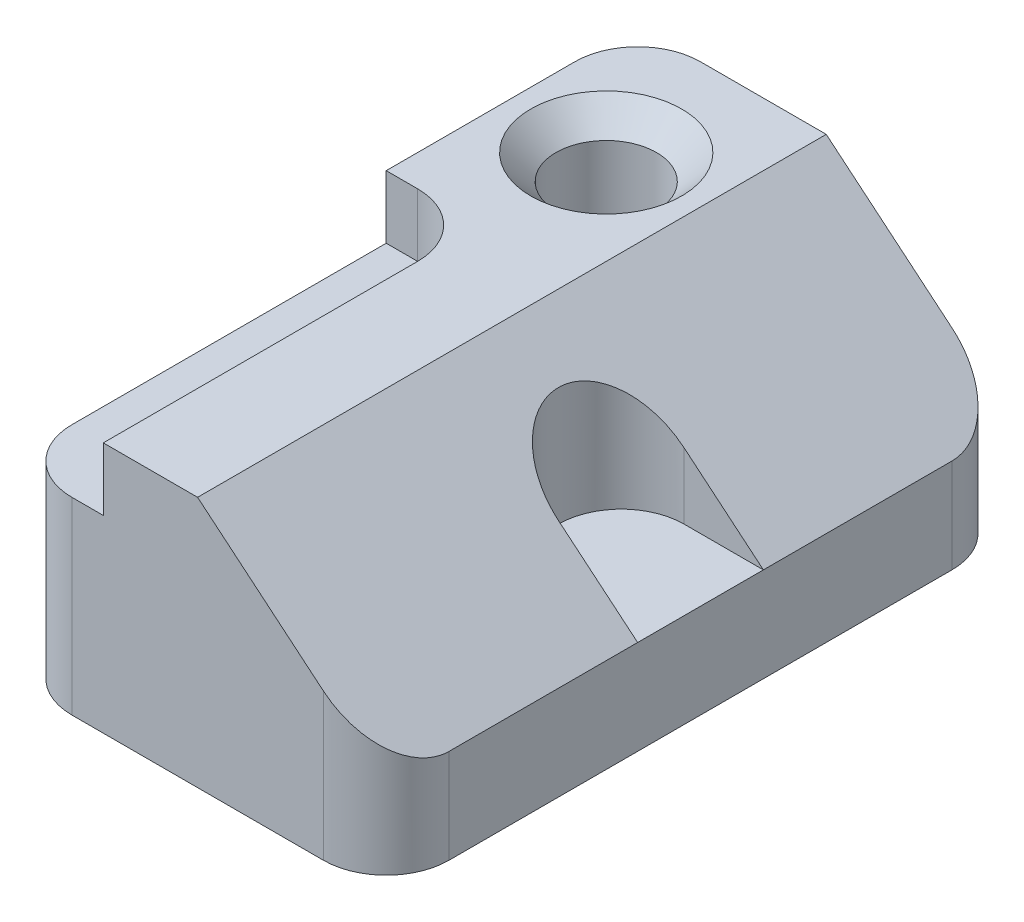
ISO-10303-21;
HEADER;
FILE_DESCRIPTION(('STEP AP214'),'2;1');
FILE_NAME('part.step','',(''),(''),'','','');
FILE_SCHEMA(('AUTOMOTIVE_DESIGN { 1 0 10303 214 1 1 1 1 }'));
ENDSEC;
DATA;
#1=APPLICATION_CONTEXT('core data for automotive mechanical design processes');
#2=APPLICATION_PROTOCOL_DEFINITION('international standard','automotive_design',2000,#1);
#3=PRODUCT_CONTEXT('',#1,'mechanical');
#4=PRODUCT('Part','Part','',(#3));
#5=PRODUCT_RELATED_PRODUCT_CATEGORY('part','',(#4));
#6=PRODUCT_DEFINITION_FORMATION('','',#4);
#7=PRODUCT_DEFINITION_CONTEXT('part definition',#1,'design');
#8=PRODUCT_DEFINITION('design','',#6,#7);
#9=PRODUCT_DEFINITION_SHAPE('','',#8);
#10=(LENGTH_UNIT() NAMED_UNIT(*) SI_UNIT(.MILLI.,.METRE.));
#11=(NAMED_UNIT(*) PLANE_ANGLE_UNIT() SI_UNIT($,.RADIAN.));
#12=(NAMED_UNIT(*) SI_UNIT($,.STERADIAN.) SOLID_ANGLE_UNIT());
#13=UNCERTAINTY_MEASURE_WITH_UNIT(LENGTH_MEASURE(1.E-05),#10,'distance_accuracy_value','');
#14=(GEOMETRIC_REPRESENTATION_CONTEXT(3) GLOBAL_UNCERTAINTY_ASSIGNED_CONTEXT((#13)) GLOBAL_UNIT_ASSIGNED_CONTEXT((#10,
#11,#12)) REPRESENTATION_CONTEXT('',''));
#15=CARTESIAN_POINT('',(0.,0.,0.));
#16=DIRECTION('',(0.,0.,1.));
#17=DIRECTION('',(1.,0.,0.));
#18=AXIS2_PLACEMENT_3D('',#15,#16,#17);
#19=CARTESIAN_POINT('',(0.,50.8,127.));
#20=DIRECTION('',(0.,1.,0.));
#21=DIRECTION('',(0.,0.,1.));
#22=AXIS2_PLACEMENT_3D('',#19,#20,#21);
#23=PLANE('',#22);
#24=CARTESIAN_POINT('',(19.05,50.8,25.4));
#25=DIRECTION('',(0.,1.,0.));
#26=DIRECTION('',(0.,0.,1.));
#27=AXIS2_PLACEMENT_3D('',#24,#25,#26);
#28=CIRCLE('',#27,15.24);
#29=CARTESIAN_POINT('',(19.05,50.8,40.64));
#30=VERTEX_POINT('',#29);
#31=EDGE_CURVE('E226',#30,#30,#28,.F.);
#32=ORIENTED_EDGE('',*,*,#31,.T.);
#33=EDGE_LOOP('',(#32));
#34=FACE_BOUND('',#33,.T.);
#35=DIRECTION('',(1.,0.,0.));
#36=VECTOR('',#35,1.);
#37=CARTESIAN_POINT('',(0.,50.8,0.));
#38=LINE('',#37,#36);
#39=CARTESIAN_POINT('',(12.7,50.8,0.));
#40=VERTEX_POINT('',#39);
#41=CARTESIAN_POINT('',(38.1,50.8,0.));
#42=VERTEX_POINT('',#41);
#43=EDGE_CURVE('E301',#40,#42,#38,.T.);
#44=ORIENTED_EDGE('',*,*,#43,.F.);
#45=CARTESIAN_POINT('',(12.7,50.8,12.7));
#46=DIRECTION('',(0.,1.,0.));
#47=DIRECTION('',(0.,0.,1.));
#48=AXIS2_PLACEMENT_3D('',#45,#46,#47);
#49=CIRCLE('',#48,12.7);
#50=CARTESIAN_POINT('',(0.,50.8,12.7));
#51=VERTEX_POINT('',#50);
#52=EDGE_CURVE('E64',#40,#51,#49,.T.);
#53=ORIENTED_EDGE('',*,*,#52,.T.);
#54=DIRECTION('',(0.,0.,-1.));
#55=VECTOR('',#54,1.);
#56=CARTESIAN_POINT('',(0.,50.8,127.));
#57=LINE('',#56,#55);
#58=CARTESIAN_POINT('',(0.,50.8,50.8));
#59=VERTEX_POINT('',#58);
#60=EDGE_CURVE('E202',#59,#51,#57,.T.);
#61=ORIENTED_EDGE('',*,*,#60,.F.);
#62=DIRECTION('',(1.,0.,0.));
#63=VECTOR('',#62,1.);
#64=CARTESIAN_POINT('',(0.,50.8,50.8));
#65=LINE('',#64,#63);
#66=CARTESIAN_POINT('',(6.35,50.8,50.8));
#67=VERTEX_POINT('',#66);
#68=EDGE_CURVE('E222',#59,#67,#65,.T.);
#69=ORIENTED_EDGE('',*,*,#68,.T.);
#70=CARTESIAN_POINT('',(6.35,50.8,63.5));
#71=DIRECTION('',(0.,1.,0.));
#72=DIRECTION('',(0.,0.,1.));
#73=AXIS2_PLACEMENT_3D('',#70,#71,#72);
#74=CIRCLE('',#73,12.7);
#75=CARTESIAN_POINT('',(19.05,50.8,63.5));
#76=VERTEX_POINT('',#75);
#77=EDGE_CURVE('E188',#67,#76,#74,.F.);
#78=ORIENTED_EDGE('',*,*,#77,.T.);
#79=DIRECTION('',(0.,0.,1.));
#80=VECTOR('',#79,1.);
#81=CARTESIAN_POINT('',(19.05,50.8,127.));
#82=LINE('',#81,#80);
#83=CARTESIAN_POINT('',(19.05,50.8,127.));
#84=VERTEX_POINT('',#83);
#85=EDGE_CURVE('E324',#76,#84,#82,.T.);
#86=ORIENTED_EDGE('',*,*,#85,.T.);
#87=DIRECTION('',(1.,0.,0.));
#88=VECTOR('',#87,1.);
#89=CARTESIAN_POINT('',(0.,50.8,127.));
#90=LINE('',#89,#88);
#91=CARTESIAN_POINT('',(38.1,50.8,127.));
#92=VERTEX_POINT('',#91);
#93=EDGE_CURVE('E316',#84,#92,#90,.T.);
#94=ORIENTED_EDGE('',*,*,#93,.T.);
#95=DIRECTION('',(0.,0.,-1.));
#96=VECTOR('',#95,1.);
#97=CARTESIAN_POINT('',(38.1,50.8,127.));
#98=LINE('',#97,#96);
#99=EDGE_CURVE('E196',#92,#42,#98,.T.);
#100=ORIENTED_EDGE('',*,*,#99,.T.);
#101=EDGE_LOOP('',(#44,#53,#61,#69,#78,#86,#94,#100));
#102=FACE_BOUND('',#101,.T.);
#103=ADVANCED_FACE('F41',(#34,#102),#23,.T.);
#104=CARTESIAN_POINT('',(0.,0.,127.));
#105=DIRECTION('',(-1.,0.,0.));
#106=DIRECTION('',(0.,0.,1.));
#107=AXIS2_PLACEMENT_3D('',#104,#105,#106);
#108=PLANE('',#107);
#109=ORIENTED_EDGE('',*,*,#60,.T.);
#110=DIRECTION('',(0.,1.,0.));
#111=VECTOR('',#110,1.);
#112=CARTESIAN_POINT('',(0.,0.,12.7));
#113=LINE('',#112,#111);
#114=CARTESIAN_POINT('',(0.,0.,12.7));
#115=VERTEX_POINT('',#114);
#116=EDGE_CURVE('E50',#51,#115,#113,.F.);
#117=ORIENTED_EDGE('',*,*,#116,.T.);
#118=DIRECTION('',(0.,0.,-1.));
#119=VECTOR('',#118,1.);
#120=CARTESIAN_POINT('',(0.,0.,127.));
#121=LINE('',#120,#119);
#122=CARTESIAN_POINT('',(0.,0.,114.3));
#123=VERTEX_POINT('',#122);
#124=EDGE_CURVE('E210',#123,#115,#121,.T.);
#125=ORIENTED_EDGE('',*,*,#124,.F.);
#126=DIRECTION('',(0.,1.,0.));
#127=VECTOR('',#126,1.);
#128=CARTESIAN_POINT('',(0.,38.1,114.3));
#129=LINE('',#128,#127);
#130=CARTESIAN_POINT('',(0.,38.1,114.3));
#131=VERTEX_POINT('',#130);
#132=EDGE_CURVE('E251',#123,#131,#129,.T.);
#133=ORIENTED_EDGE('',*,*,#132,.T.);
#134=DIRECTION('',(0.,0.,1.));
#135=VECTOR('',#134,1.);
#136=CARTESIAN_POINT('',(0.,38.1,127.));
#137=LINE('',#136,#135);
#138=CARTESIAN_POINT('',(0.,38.1,50.8));
#139=VERTEX_POINT('',#138);
#140=EDGE_CURVE('E341',#139,#131,#137,.T.);
#141=ORIENTED_EDGE('',*,*,#140,.F.);
#142=DIRECTION('',(0.,-1.,0.));
#143=VECTOR('',#142,1.);
#144=CARTESIAN_POINT('',(0.,50.800012,50.8));
#145=LINE('',#144,#143);
#146=EDGE_CURVE('E327',#59,#139,#145,.T.);
#147=ORIENTED_EDGE('',*,*,#146,.F.);
#148=EDGE_LOOP('',(#109,#117,#125,#133,#141,#147));
#149=FACE_BOUND('',#148,.T.);
#150=ADVANCED_FACE('F376',(#149),#108,.T.);
#151=CARTESIAN_POINT('',(0.,0.,127.));
#152=DIRECTION('',(0.,0.,-1.));
#153=DIRECTION('',(-1.,0.,0.));
#154=AXIS2_PLACEMENT_3D('',#151,#152,#153);
#155=PLANE('',#154);
#156=DIRECTION('',(-1.,0.,0.));
#157=VECTOR('',#156,1.);
#158=CARTESIAN_POINT('',(76.2,0.,127.));
#159=LINE('',#158,#157);
#160=CARTESIAN_POINT('',(63.5,0.,127.));
#161=VERTEX_POINT('',#160);
#162=CARTESIAN_POINT('',(12.7,0.,127.));
#163=VERTEX_POINT('',#162);
#164=EDGE_CURVE('E310',#161,#163,#159,.T.);
#165=ORIENTED_EDGE('',*,*,#164,.F.);
#166=DIRECTION('',(0.,-1.,0.));
#167=VECTOR('',#166,1.);
#168=CARTESIAN_POINT('',(63.5,19.05,127.));
#169=LINE('',#168,#167);
#170=CARTESIAN_POINT('',(63.5,29.6333333333333,127.));
#171=VERTEX_POINT('',#170);
#172=EDGE_CURVE('E272',#161,#171,#169,.F.);
#173=ORIENTED_EDGE('',*,*,#172,.T.);
#174=DIRECTION('',(0.768221279597376,-0.64018439966448,0.));
#175=VECTOR('',#174,1.);
#176=CARTESIAN_POINT('',(38.1,50.8,127.));
#177=LINE('',#176,#175);
#178=EDGE_CURVE('E216',#92,#171,#177,.T.);
#179=ORIENTED_EDGE('',*,*,#178,.F.);
#180=ORIENTED_EDGE('',*,*,#93,.F.);
#181=DIRECTION('',(0.,1.,0.));
#182=VECTOR('',#181,1.);
#183=CARTESIAN_POINT('',(19.05,0.,127.));
#184=LINE('',#183,#182);
#185=CARTESIAN_POINT('',(19.05,38.1,127.));
#186=VERTEX_POINT('',#185);
#187=EDGE_CURVE('E230',#186,#84,#184,.T.);
#188=ORIENTED_EDGE('',*,*,#187,.F.);
#189=DIRECTION('',(1.,0.,0.));
#190=VECTOR('',#189,1.);
#191=CARTESIAN_POINT('',(0.,38.1,127.));
#192=LINE('',#191,#190);
#193=CARTESIAN_POINT('',(12.7,38.1,127.));
#194=VERTEX_POINT('',#193);
#195=EDGE_CURVE('E338',#194,#186,#192,.T.);
#196=ORIENTED_EDGE('',*,*,#195,.F.);
#197=DIRECTION('',(0.,1.,0.));
#198=VECTOR('',#197,1.);
#199=CARTESIAN_POINT('',(12.7,0.,127.));
#200=LINE('',#199,#198);
#201=EDGE_CURVE('E258',#194,#163,#200,.F.);
#202=ORIENTED_EDGE('',*,*,#201,.T.);
#203=EDGE_LOOP('',(#165,#173,#179,#180,#188,#196,#202));
#204=FACE_BOUND('',#203,.T.);
#205=ADVANCED_FACE('F367',(#204),#155,.F.);
#206=CARTESIAN_POINT('',(76.2,19.05,127.));
#207=DIRECTION('',(1.,0.,0.));
#208=DIRECTION('',(0.,0.,-1.));
#209=AXIS2_PLACEMENT_3D('',#206,#207,#208);
#210=PLANE('',#209);
#211=DIRECTION('',(0.,0.,-1.));
#212=VECTOR('',#211,1.);
#213=CARTESIAN_POINT('',(76.2,0.,127.));
#214=LINE('',#213,#212);
#215=CARTESIAN_POINT('',(76.2,0.,114.3));
#216=VERTEX_POINT('',#215);
#217=CARTESIAN_POINT('',(76.2,0.,12.7));
#218=VERTEX_POINT('',#217);
#219=EDGE_CURVE('E213',#216,#218,#214,.T.);
#220=ORIENTED_EDGE('',*,*,#219,.T.);
#221=DIRECTION('',(0.,-1.,0.));
#222=VECTOR('',#221,1.);
#223=CARTESIAN_POINT('',(76.2,19.05,12.7));
#224=LINE('',#223,#222);
#225=CARTESIAN_POINT('',(76.2,19.05,12.7));
#226=VERTEX_POINT('',#225);
#227=EDGE_CURVE('E193',#218,#226,#224,.F.);
#228=ORIENTED_EDGE('',*,*,#227,.T.);
#229=DIRECTION('',(0.,0.,-1.));
#230=VECTOR('',#229,1.);
#231=CARTESIAN_POINT('',(76.2,19.05,127.));
#232=LINE('',#231,#230);
#233=CARTESIAN_POINT('',(76.2,19.05,50.8));
#234=VERTEX_POINT('',#233);
#235=EDGE_CURVE('E183',#234,#226,#232,.T.);
#236=ORIENTED_EDGE('',*,*,#235,.F.);
#237=DIRECTION('',(0.,0.,-1.));
#238=VECTOR('',#237,1.);
#239=CARTESIAN_POINT('',(76.2,19.05,50.8));
#240=LINE('',#239,#238);
#241=CARTESIAN_POINT('',(76.2,19.05,76.2));
#242=VERTEX_POINT('',#241);
#243=EDGE_CURVE('E166',#242,#234,#240,.T.);
#244=ORIENTED_EDGE('',*,*,#243,.F.);
#245=CARTESIAN_POINT('',(76.2,19.05,114.3));
#246=VERTEX_POINT('',#245);
#247=EDGE_CURVE('E195',#246,#242,#232,.T.);
#248=ORIENTED_EDGE('',*,*,#247,.F.);
#249=DIRECTION('',(0.,-1.,0.));
#250=VECTOR('',#249,1.);
#251=CARTESIAN_POINT('',(76.2,0.,114.3));
#252=LINE('',#251,#250);
#253=EDGE_CURVE('E265',#246,#216,#252,.T.);
#254=ORIENTED_EDGE('',*,*,#253,.T.);
#255=EDGE_LOOP('',(#220,#228,#236,#244,#248,#254));
#256=FACE_BOUND('',#255,.T.);
#257=ADVANCED_FACE('F191',(#256),#210,.T.);
#258=CARTESIAN_POINT('',(38.1,50.8,127.));
#259=DIRECTION('',(0.64018439966448,0.768221279597376,0.));
#260=DIRECTION('',(-0.768221279597376,0.64018439966448,0.));
#261=AXIS2_PLACEMENT_3D('',#258,#259,#260);
#262=PLANE('',#261);
#263=ORIENTED_EDGE('',*,*,#235,.T.);
#264=CARTESIAN_POINT('',(63.5,29.6333333333333,12.7));
#265=DIRECTION('',(0.64018439966448,0.768221279597376,0.));
#266=DIRECTION('',(0.768221279597376,-0.64018439966448,0.));
#267=AXIS2_PLACEMENT_3D('',#264,#265,#266);
#268=ELLIPSE('',#267,16.5316951473357,12.7);
#269=CARTESIAN_POINT('',(63.5,29.6333333333333,0.));
#270=VERTEX_POINT('',#269);
#271=EDGE_CURVE('E287',#226,#270,#268,.T.);
#272=ORIENTED_EDGE('',*,*,#271,.T.);
#273=DIRECTION('',(0.768221279597376,-0.64018439966448,0.));
#274=VECTOR('',#273,1.);
#275=CARTESIAN_POINT('',(38.1,50.8,0.));
#276=LINE('',#275,#274);
#277=EDGE_CURVE('E205',#42,#270,#276,.T.);
#278=ORIENTED_EDGE('',*,*,#277,.F.);
#279=ORIENTED_EDGE('',*,*,#99,.F.);
#280=ORIENTED_EDGE('',*,*,#178,.T.);
#281=CARTESIAN_POINT('',(63.5,29.6333333333333,114.3));
#282=DIRECTION('',(0.64018439966448,0.768221279597376,0.));
#283=DIRECTION('',(-0.768221279597376,0.64018439966448,0.));
#284=AXIS2_PLACEMENT_3D('',#281,#282,#283);
#285=ELLIPSE('',#284,16.5316951473357,12.7);
#286=EDGE_CURVE('E275',#171,#246,#285,.T.);
#287=ORIENTED_EDGE('',*,*,#286,.T.);
#288=ORIENTED_EDGE('',*,*,#247,.T.);
#289=DIRECTION('',(0.768221279597376,-0.64018439966448,0.));
#290=VECTOR('',#289,1.);
#291=CARTESIAN_POINT('',(38.1,50.8,76.2));
#292=LINE('',#291,#290);
#293=CARTESIAN_POINT('',(60.198,32.385,76.2));
#294=VERTEX_POINT('',#293);
#295=EDGE_CURVE('E248',#294,#242,#292,.T.);
#296=ORIENTED_EDGE('',*,*,#295,.F.);
#297=CARTESIAN_POINT('',(60.198,32.385,63.5));
#298=DIRECTION('',(0.64018439966448,0.768221279597376,0.));
#299=DIRECTION('',(-0.768221279597376,0.64018439966448,0.));
#300=AXIS2_PLACEMENT_3D('',#297,#298,#299);
#301=ELLIPSE('',#300,16.5316951473358,12.7);
#302=CARTESIAN_POINT('',(60.198,32.385,50.8));
#303=VERTEX_POINT('',#302);
#304=EDGE_CURVE('E186',#303,#294,#301,.T.);
#305=ORIENTED_EDGE('',*,*,#304,.F.);
#306=DIRECTION('',(-0.768221279597376,0.64018439966448,0.));
#307=VECTOR('',#306,1.);
#308=CARTESIAN_POINT('',(38.1,50.8,50.8));
#309=LINE('',#308,#307);
#310=EDGE_CURVE('E158',#234,#303,#309,.T.);
#311=ORIENTED_EDGE('',*,*,#310,.F.);
#312=EDGE_LOOP('',(#263,#272,#278,#279,#280,#287,#288,#296,#305,#311));
#313=FACE_BOUND('',#312,.T.);
#314=ADVANCED_FACE('F182',(#313),#262,.T.);
#315=CARTESIAN_POINT('',(76.2,0.,127.));
#316=DIRECTION('',(0.,-1.,0.));
#317=DIRECTION('',(1.,0.,0.));
#318=AXIS2_PLACEMENT_3D('',#315,#316,#317);
#319=PLANE('',#318);
#320=CARTESIAN_POINT('',(19.05,0.,25.4));
#321=DIRECTION('',(0.,-1.,0.));
#322=DIRECTION('',(1.,0.,0.));
#323=AXIS2_PLACEMENT_3D('',#320,#321,#322);
#324=CIRCLE('',#323,10.16);
#325=CARTESIAN_POINT('',(29.21,0.,25.4));
#326=VERTEX_POINT('',#325);
#327=EDGE_CURVE('E217',#326,#326,#324,.T.);
#328=ORIENTED_EDGE('',*,*,#327,.F.);
#329=EDGE_LOOP('',(#328));
#330=FACE_BOUND('',#329,.T.);
#331=ORIENTED_EDGE('',*,*,#124,.T.);
#332=CARTESIAN_POINT('',(12.7,0.,12.7));
#333=DIRECTION('',(0.,-1.,0.));
#334=DIRECTION('',(1.,0.,0.));
#335=AXIS2_PLACEMENT_3D('',#332,#333,#334);
#336=CIRCLE('',#335,12.7);
#337=CARTESIAN_POINT('',(12.7,0.,0.));
#338=VERTEX_POINT('',#337);
#339=EDGE_CURVE('E11',#115,#338,#336,.T.);
#340=ORIENTED_EDGE('',*,*,#339,.T.);
#341=DIRECTION('',(-1.,0.,0.));
#342=VECTOR('',#341,1.);
#343=CARTESIAN_POINT('',(76.2,0.,0.));
#344=LINE('',#343,#342);
#345=CARTESIAN_POINT('',(63.5,0.,0.));
#346=VERTEX_POINT('',#345);
#347=EDGE_CURVE('E221',#346,#338,#344,.T.);
#348=ORIENTED_EDGE('',*,*,#347,.F.);
#349=CARTESIAN_POINT('',(63.5,0.,12.7));
#350=DIRECTION('',(0.,-1.,0.));
#351=DIRECTION('',(1.,0.,0.));
#352=AXIS2_PLACEMENT_3D('',#349,#350,#351);
#353=CIRCLE('',#352,12.7);
#354=EDGE_CURVE('E282',#346,#218,#353,.T.);
#355=ORIENTED_EDGE('',*,*,#354,.T.);
#356=ORIENTED_EDGE('',*,*,#219,.F.);
#357=CARTESIAN_POINT('',(63.5,0.,114.3));
#358=DIRECTION('',(0.,-1.,0.));
#359=DIRECTION('',(1.,0.,0.));
#360=AXIS2_PLACEMENT_3D('',#357,#358,#359);
#361=CIRCLE('',#360,12.7);
#362=EDGE_CURVE('E269',#216,#161,#361,.T.);
#363=ORIENTED_EDGE('',*,*,#362,.T.);
#364=ORIENTED_EDGE('',*,*,#164,.T.);
#365=CARTESIAN_POINT('',(12.7,0.,114.3));
#366=DIRECTION('',(0.,-1.,0.));
#367=DIRECTION('',(1.,0.,0.));
#368=AXIS2_PLACEMENT_3D('',#365,#366,#367);
#369=CIRCLE('',#368,12.7);
#370=EDGE_CURVE('E262',#163,#123,#369,.T.);
#371=ORIENTED_EDGE('',*,*,#370,.T.);
#372=EDGE_LOOP('',(#331,#340,#348,#355,#356,#363,#364,#371));
#373=FACE_BOUND('',#372,.T.);
#374=ADVANCED_FACE('F365',(#330,#373),#319,.T.);
#375=CARTESIAN_POINT('',(0.,0.,0.));
#376=DIRECTION('',(0.,0.,-1.));
#377=DIRECTION('',(-1.,0.,0.));
#378=AXIS2_PLACEMENT_3D('',#375,#376,#377);
#379=PLANE('',#378);
#380=ORIENTED_EDGE('',*,*,#347,.T.);
#381=DIRECTION('',(0.,1.,0.));
#382=VECTOR('',#381,1.);
#383=CARTESIAN_POINT('',(12.7,0.,0.));
#384=LINE('',#383,#382);
#385=EDGE_CURVE('E290',#338,#40,#384,.T.);
#386=ORIENTED_EDGE('',*,*,#385,.T.);
#387=ORIENTED_EDGE('',*,*,#43,.T.);
#388=ORIENTED_EDGE('',*,*,#277,.T.);
#389=DIRECTION('',(0.,-1.,0.));
#390=VECTOR('',#389,1.);
#391=CARTESIAN_POINT('',(63.5,0.,0.));
#392=LINE('',#391,#390);
#393=EDGE_CURVE('E278',#270,#346,#392,.T.);
#394=ORIENTED_EDGE('',*,*,#393,.T.);
#395=EDGE_LOOP('',(#380,#386,#387,#388,#394));
#396=FACE_BOUND('',#395,.T.);
#397=ADVANCED_FACE('F299',(#396),#379,.T.);
#398=CARTESIAN_POINT('',(19.05,-76.2,25.4));
#399=DIRECTION('',(0.,1.,0.));
#400=DIRECTION('',(0.,0.,1.));
#401=AXIS2_PLACEMENT_3D('',#398,#399,#400);
#402=CYLINDRICAL_SURFACE('',#401,10.16);
#403=CARTESIAN_POINT('',(19.05,45.72,25.4));
#404=DIRECTION('',(0.,1.,0.));
#405=DIRECTION('',(0.,0.,1.));
#406=AXIS2_PLACEMENT_3D('',#403,#404,#405);
#407=CIRCLE('',#406,10.16);
#408=CARTESIAN_POINT('',(19.05,45.72,35.56));
#409=VERTEX_POINT('',#408);
#410=EDGE_CURVE('E200',#409,#409,#407,.T.);
#411=ORIENTED_EDGE('',*,*,#410,.T.);
#412=EDGE_LOOP('',(#411));
#413=FACE_BOUND('',#412,.T.);
#414=ORIENTED_EDGE('',*,*,#327,.T.);
#415=EDGE_LOOP('',(#414));
#416=FACE_BOUND('',#415,.T.);
#417=ADVANCED_FACE('F422',(#413,#416),#402,.F.);
#418=CARTESIAN_POINT('',(19.05,45.72,25.4));
#419=DIRECTION('',(0.,1.,0.));
#420=DIRECTION('',(0.,0.,1.));
#421=AXIS2_PLACEMENT_3D('',#418,#419,#420);
#422=CONICAL_SURFACE('',#421,10.16,0.785398163397448);
#423=ORIENTED_EDGE('',*,*,#31,.F.);
#424=EDGE_LOOP('',(#423));
#425=FACE_BOUND('',#424,.T.);
#426=ORIENTED_EDGE('',*,*,#410,.F.);
#427=EDGE_LOOP('',(#426));
#428=FACE_BOUND('',#427,.T.);
#429=ADVANCED_FACE('F417',(#425,#428),#422,.F.);
#430=CARTESIAN_POINT('',(19.05,50.800012,127.));
#431=DIRECTION('',(-1.,0.,0.));
#432=DIRECTION('',(0.,0.,1.));
#433=AXIS2_PLACEMENT_3D('',#430,#431,#432);
#434=PLANE('',#433);
#435=ORIENTED_EDGE('',*,*,#85,.F.);
#436=DIRECTION('',(0.,-1.,0.));
#437=VECTOR('',#436,1.);
#438=CARTESIAN_POINT('',(19.05,38.1,63.5));
#439=LINE('',#438,#437);
#440=CARTESIAN_POINT('',(19.05,38.1,63.5));
#441=VERTEX_POINT('',#440);
#442=EDGE_CURVE('E234',#76,#441,#439,.T.);
#443=ORIENTED_EDGE('',*,*,#442,.T.);
#444=DIRECTION('',(0.,0.,-1.));
#445=VECTOR('',#444,1.);
#446=CARTESIAN_POINT('',(19.05,38.1,127.));
#447=LINE('',#446,#445);
#448=EDGE_CURVE('E334',#186,#441,#447,.T.);
#449=ORIENTED_EDGE('',*,*,#448,.F.);
#450=ORIENTED_EDGE('',*,*,#187,.T.);
#451=EDGE_LOOP('',(#435,#443,#449,#450));
#452=FACE_BOUND('',#451,.T.);
#453=ADVANCED_FACE('F392',(#452),#434,.T.);
#454=CARTESIAN_POINT('',(0.,50.800012,50.8));
#455=DIRECTION('',(0.,0.,1.));
#456=DIRECTION('',(1.,0.,0.));
#457=AXIS2_PLACEMENT_3D('',#454,#455,#456);
#458=PLANE('',#457);
#459=DIRECTION('',(-1.,0.,0.));
#460=VECTOR('',#459,1.);
#461=CARTESIAN_POINT('',(0.,38.1,50.8));
#462=LINE('',#461,#460);
#463=CARTESIAN_POINT('',(6.35,38.1,50.8));
#464=VERTEX_POINT('',#463);
#465=EDGE_CURVE('E331',#464,#139,#462,.T.);
#466=ORIENTED_EDGE('',*,*,#465,.F.);
#467=DIRECTION('',(0.,-1.,0.));
#468=VECTOR('',#467,1.);
#469=CARTESIAN_POINT('',(6.35,50.8,50.8));
#470=LINE('',#469,#468);
#471=EDGE_CURVE('E241',#464,#67,#470,.F.);
#472=ORIENTED_EDGE('',*,*,#471,.T.);
#473=ORIENTED_EDGE('',*,*,#68,.F.);
#474=ORIENTED_EDGE('',*,*,#146,.T.);
#475=EDGE_LOOP('',(#466,#472,#473,#474));
#476=FACE_BOUND('',#475,.T.);
#477=ADVANCED_FACE('F384',(#476),#458,.T.);
#478=CARTESIAN_POINT('',(0.,38.1,0.));
#479=DIRECTION('',(0.,-1.,0.));
#480=DIRECTION('',(0.,0.,-1.));
#481=AXIS2_PLACEMENT_3D('',#478,#479,#480);
#482=PLANE('',#481);
#483=ORIENTED_EDGE('',*,*,#140,.T.);
#484=CARTESIAN_POINT('',(12.7,38.1,114.3));
#485=DIRECTION('',(0.,-1.,0.));
#486=DIRECTION('',(0.,0.,-1.));
#487=AXIS2_PLACEMENT_3D('',#484,#485,#486);
#488=CIRCLE('',#487,12.7);
#489=EDGE_CURVE('E255',#131,#194,#488,.F.);
#490=ORIENTED_EDGE('',*,*,#489,.T.);
#491=ORIENTED_EDGE('',*,*,#195,.T.);
#492=ORIENTED_EDGE('',*,*,#448,.T.);
#493=CARTESIAN_POINT('',(6.35,38.1,63.5));
#494=DIRECTION('',(0.,-1.,0.));
#495=DIRECTION('',(0.,0.,-1.));
#496=AXIS2_PLACEMENT_3D('',#493,#494,#495);
#497=CIRCLE('',#496,12.7);
#498=EDGE_CURVE('E238',#441,#464,#497,.F.);
#499=ORIENTED_EDGE('',*,*,#498,.T.);
#500=ORIENTED_EDGE('',*,*,#465,.T.);
#501=EDGE_LOOP('',(#483,#490,#491,#492,#499,#500));
#502=FACE_BOUND('',#501,.T.);
#503=ADVANCED_FACE('F380',(#502),#482,.F.);
#504=CARTESIAN_POINT('',(6.35,50.800012,63.5));
#505=DIRECTION('',(0.,1.,0.));
#506=DIRECTION('',(0.,0.,1.));
#507=AXIS2_PLACEMENT_3D('',#504,#505,#506);
#508=CYLINDRICAL_SURFACE('',#507,12.7);
#509=ORIENTED_EDGE('',*,*,#77,.F.);
#510=ORIENTED_EDGE('',*,*,#471,.F.);
#511=ORIENTED_EDGE('',*,*,#498,.F.);
#512=ORIENTED_EDGE('',*,*,#442,.F.);
#513=EDGE_LOOP('',(#509,#510,#511,#512));
#514=FACE_BOUND('',#513,.T.);
#515=ADVANCED_FACE('F389',(#514),#508,.F.);
#516=CARTESIAN_POINT('',(76.2,19.05,76.2));
#517=DIRECTION('',(0.,0.,1.));
#518=DIRECTION('',(1.,0.,0.));
#519=AXIS2_PLACEMENT_3D('',#516,#517,#518);
#520=PLANE('',#519);
#521=ORIENTED_EDGE('',*,*,#295,.T.);
#522=DIRECTION('',(1.,0.,0.));
#523=VECTOR('',#522,1.);
#524=CARTESIAN_POINT('',(76.2,19.05,76.2));
#525=LINE('',#524,#523);
#526=CARTESIAN_POINT('',(60.198,19.05,76.2));
#527=VERTEX_POINT('',#526);
#528=EDGE_CURVE('E172',#527,#242,#525,.T.);
#529=ORIENTED_EDGE('',*,*,#528,.F.);
#530=DIRECTION('',(0.,1.,0.));
#531=VECTOR('',#530,1.);
#532=CARTESIAN_POINT('',(60.198,19.05,76.2));
#533=LINE('',#532,#531);
#534=EDGE_CURVE('E345',#527,#294,#533,.T.);
#535=ORIENTED_EDGE('',*,*,#534,.T.);
#536=EDGE_LOOP('',(#521,#529,#535));
#537=FACE_BOUND('',#536,.T.);
#538=ADVANCED_FACE('F356',(#537),#520,.F.);
#539=CARTESIAN_POINT('',(60.198,19.05,63.5));
#540=DIRECTION('',(0.,1.,0.));
#541=DIRECTION('',(0.,0.,1.));
#542=AXIS2_PLACEMENT_3D('',#539,#540,#541);
#543=CYLINDRICAL_SURFACE('',#542,12.7);
#544=ORIENTED_EDGE('',*,*,#304,.T.);
#545=ORIENTED_EDGE('',*,*,#534,.F.);
#546=CARTESIAN_POINT('',(60.198,19.05,63.5));
#547=DIRECTION('',(0.,1.,0.));
#548=DIRECTION('',(0.,0.,1.));
#549=AXIS2_PLACEMENT_3D('',#546,#547,#548);
#550=CIRCLE('',#549,12.7);
#551=CARTESIAN_POINT('',(60.198,19.05,50.8));
#552=VERTEX_POINT('',#551);
#553=EDGE_CURVE('E165',#552,#527,#550,.T.);
#554=ORIENTED_EDGE('',*,*,#553,.F.);
#555=DIRECTION('',(0.,1.,0.));
#556=VECTOR('',#555,1.);
#557=CARTESIAN_POINT('',(60.198,19.05,50.8));
#558=LINE('',#557,#556);
#559=EDGE_CURVE('E160',#552,#303,#558,.T.);
#560=ORIENTED_EDGE('',*,*,#559,.T.);
#561=EDGE_LOOP('',(#544,#545,#554,#560));
#562=FACE_BOUND('',#561,.T.);
#563=ADVANCED_FACE('F515',(#562),#543,.F.);
#564=CARTESIAN_POINT('',(76.2,19.05,50.8));
#565=DIRECTION('',(0.,0.,-1.));
#566=DIRECTION('',(-1.,0.,0.));
#567=AXIS2_PLACEMENT_3D('',#564,#565,#566);
#568=PLANE('',#567);
#569=ORIENTED_EDGE('',*,*,#310,.T.);
#570=ORIENTED_EDGE('',*,*,#559,.F.);
#571=DIRECTION('',(-1.,0.,0.));
#572=VECTOR('',#571,1.);
#573=CARTESIAN_POINT('',(76.2,19.05,50.8));
#574=LINE('',#573,#572);
#575=EDGE_CURVE('E154',#234,#552,#574,.T.);
#576=ORIENTED_EDGE('',*,*,#575,.F.);
#577=EDGE_LOOP('',(#569,#570,#576));
#578=FACE_BOUND('',#577,.T.);
#579=ADVANCED_FACE('F156',(#578),#568,.F.);
#580=CARTESIAN_POINT('',(60.198,19.05,63.5));
#581=DIRECTION('',(0.,1.,0.));
#582=DIRECTION('',(0.,0.,1.));
#583=AXIS2_PLACEMENT_3D('',#580,#581,#582);
#584=PLANE('',#583);
#585=ORIENTED_EDGE('',*,*,#243,.T.);
#586=ORIENTED_EDGE('',*,*,#575,.T.);
#587=ORIENTED_EDGE('',*,*,#553,.T.);
#588=ORIENTED_EDGE('',*,*,#528,.T.);
#589=EDGE_LOOP('',(#585,#586,#587,#588));
#590=FACE_BOUND('',#589,.T.);
#591=ADVANCED_FACE('F170',(#590),#584,.T.);
#592=CARTESIAN_POINT('',(12.7,0.,114.3));
#593=DIRECTION('',(0.,-1.,0.));
#594=DIRECTION('',(0.,0.,-1.));
#595=AXIS2_PLACEMENT_3D('',#592,#593,#594);
#596=CYLINDRICAL_SURFACE('',#595,12.7);
#597=ORIENTED_EDGE('',*,*,#370,.F.);
#598=ORIENTED_EDGE('',*,*,#201,.F.);
#599=ORIENTED_EDGE('',*,*,#489,.F.);
#600=ORIENTED_EDGE('',*,*,#132,.F.);
#601=EDGE_LOOP('',(#597,#598,#599,#600));
#602=FACE_BOUND('',#601,.T.);
#603=ADVANCED_FACE('F375',(#602),#596,.T.);
#604=CARTESIAN_POINT('',(63.5,19.05,114.3));
#605=DIRECTION('',(0.,1.,0.));
#606=DIRECTION('',(0.,0.,1.));
#607=AXIS2_PLACEMENT_3D('',#604,#605,#606);
#608=CYLINDRICAL_SURFACE('',#607,12.7);
#609=ORIENTED_EDGE('',*,*,#286,.F.);
#610=ORIENTED_EDGE('',*,*,#172,.F.);
#611=ORIENTED_EDGE('',*,*,#362,.F.);
#612=ORIENTED_EDGE('',*,*,#253,.F.);
#613=EDGE_LOOP('',(#609,#610,#611,#612));
#614=FACE_BOUND('',#613,.T.);
#615=ADVANCED_FACE('F361',(#614),#608,.T.);
#616=CARTESIAN_POINT('',(63.5,0.,12.7));
#617=DIRECTION('',(0.,-1.,0.));
#618=DIRECTION('',(0.,0.,-1.));
#619=AXIS2_PLACEMENT_3D('',#616,#617,#618);
#620=CYLINDRICAL_SURFACE('',#619,12.7);
#621=ORIENTED_EDGE('',*,*,#271,.F.);
#622=ORIENTED_EDGE('',*,*,#227,.F.);
#623=ORIENTED_EDGE('',*,*,#354,.F.);
#624=ORIENTED_EDGE('',*,*,#393,.F.);
#625=EDGE_LOOP('',(#621,#622,#623,#624));
#626=FACE_BOUND('',#625,.T.);
#627=ADVANCED_FACE('F396',(#626),#620,.T.);
#628=CARTESIAN_POINT('',(12.7,0.,12.7));
#629=DIRECTION('',(0.,1.,0.));
#630=DIRECTION('',(0.,0.,1.));
#631=AXIS2_PLACEMENT_3D('',#628,#629,#630);
#632=CYLINDRICAL_SURFACE('',#631,12.7);
#633=ORIENTED_EDGE('',*,*,#339,.F.);
#634=ORIENTED_EDGE('',*,*,#116,.F.);
#635=ORIENTED_EDGE('',*,*,#52,.F.);
#636=ORIENTED_EDGE('',*,*,#385,.F.);
#637=EDGE_LOOP('',(#633,#634,#635,#636));
#638=FACE_BOUND('',#637,.T.);
#639=ADVANCED_FACE('F43',(#638),#632,.T.);
#640=CLOSED_SHELL('',(#103,#150,#205,#257,#314,#374,#397,#417,#429,#453,#477,#503,#515,#538,
#563,#579,#591,#603,#615,#627,#639));
#641=MANIFOLD_SOLID_BREP('B2',#640);
#642=ADVANCED_BREP_SHAPE_REPRESENTATION('',(#18,#641),#14);
#643=SHAPE_DEFINITION_REPRESENTATION(#9,#642);
ENDSEC;
END-ISO-10303-21;
